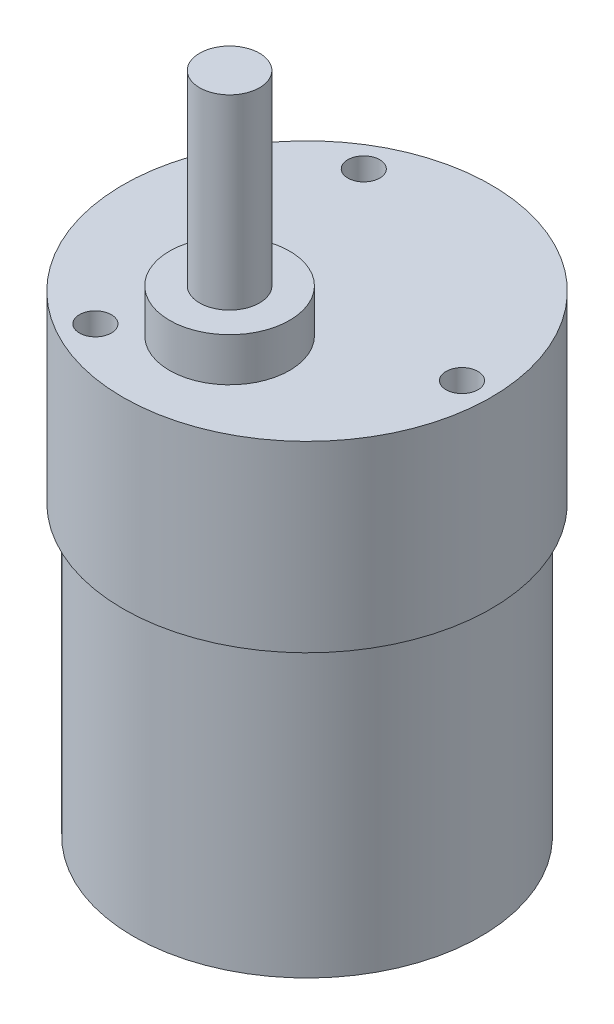
ISO-10303-21;
HEADER;
FILE_DESCRIPTION(('STEP AP214'),'2;1');
FILE_NAME('part.step','',(''),(''),'','','');
FILE_SCHEMA(('AUTOMOTIVE_DESIGN { 1 0 10303 214 1 1 1 1 }'));
ENDSEC;
DATA;
#1=APPLICATION_CONTEXT('core data for automotive mechanical design processes');
#2=APPLICATION_PROTOCOL_DEFINITION('international standard','automotive_design',2000,#1);
#3=PRODUCT_CONTEXT('',#1,'mechanical');
#4=PRODUCT('Part','Part','',(#3));
#5=PRODUCT_RELATED_PRODUCT_CATEGORY('part','',(#4));
#6=PRODUCT_DEFINITION_FORMATION('','',#4);
#7=PRODUCT_DEFINITION_CONTEXT('part definition',#1,'design');
#8=PRODUCT_DEFINITION('design','',#6,#7);
#9=PRODUCT_DEFINITION_SHAPE('','',#8);
#10=(LENGTH_UNIT() NAMED_UNIT(*) SI_UNIT(.MILLI.,.METRE.));
#11=(NAMED_UNIT(*) PLANE_ANGLE_UNIT() SI_UNIT($,.RADIAN.));
#12=(NAMED_UNIT(*) SI_UNIT($,.STERADIAN.) SOLID_ANGLE_UNIT());
#13=UNCERTAINTY_MEASURE_WITH_UNIT(LENGTH_MEASURE(1.E-05),#10,'distance_accuracy_value','');
#14=(GEOMETRIC_REPRESENTATION_CONTEXT(3) GLOBAL_UNCERTAINTY_ASSIGNED_CONTEXT((#13)) GLOBAL_UNIT_ASSIGNED_CONTEXT((#10,
#11,#12)) REPRESENTATION_CONTEXT('',''));
#15=CARTESIAN_POINT('',(0.,0.,0.));
#16=DIRECTION('',(0.,0.,1.));
#17=DIRECTION('',(1.,0.,0.));
#18=AXIS2_PLACEMENT_3D('',#15,#16,#17);
#19=CARTESIAN_POINT('',(0.,51.2826,7.70629818806232));
#20=DIRECTION('',(0.,1.,0.));
#21=DIRECTION('',(0.,0.,1.));
#22=AXIS2_PLACEMENT_3D('',#19,#20,#21);
#23=PLANE('',#22);
#24=CARTESIAN_POINT('',(0.,51.2826,7.70629818806232));
#25=DIRECTION('',(0.,1.,0.));
#26=DIRECTION('',(0.,0.,1.));
#27=AXIS2_PLACEMENT_3D('',#24,#25,#26);
#28=CIRCLE('',#27,5.969);
#29=CARTESIAN_POINT('',(0.,51.2826,13.6752981880623));
#30=VERTEX_POINT('',#29);
#31=EDGE_CURVE('E64',#30,#30,#28,.T.);
#32=ORIENTED_EDGE('',*,*,#31,.T.);
#33=EDGE_LOOP('',(#32));
#34=FACE_BOUND('',#33,.T.);
#35=CARTESIAN_POINT('',(0.,51.2826,7.70629818806232));
#36=DIRECTION('',(0.,1.,0.));
#37=DIRECTION('',(0.,0.,1.));
#38=AXIS2_PLACEMENT_3D('',#35,#36,#37);
#39=CIRCLE('',#38,2.97815);
#40=CARTESIAN_POINT('',(0.,51.2826,10.6844481880623));
#41=VERTEX_POINT('',#40);
#42=EDGE_CURVE('E73',#41,#41,#39,.T.);
#43=ORIENTED_EDGE('',*,*,#42,.F.);
#44=EDGE_LOOP('',(#43));
#45=FACE_BOUND('',#44,.T.);
#46=ADVANCED_FACE('F30',(#34,#45),#23,.T.);
#47=CARTESIAN_POINT('',(0.,46.9646,0.));
#48=DIRECTION('',(0.,1.,0.));
#49=DIRECTION('',(0.,0.,1.));
#50=AXIS2_PLACEMENT_3D('',#47,#48,#49);
#51=PLANE('',#50);
#52=CARTESIAN_POINT('',(0.,46.9646,0.));
#53=DIRECTION('',(0.,1.,0.));
#54=DIRECTION('',(0.,0.,1.));
#55=AXIS2_PLACEMENT_3D('',#52,#53,#54);
#56=CIRCLE('',#55,18.30705);
#57=CARTESIAN_POINT('',(0.,46.9646,18.30705));
#58=VERTEX_POINT('',#57);
#59=EDGE_CURVE('E41',#58,#58,#56,.T.);
#60=ORIENTED_EDGE('',*,*,#59,.T.);
#61=EDGE_LOOP('',(#60));
#62=FACE_BOUND('',#61,.T.);
#63=CARTESIAN_POINT('',(-7.70629818806238,46.9646,13.3477));
#64=DIRECTION('',(0.,1.,0.));
#65=DIRECTION('',(0.,0.,1.));
#66=AXIS2_PLACEMENT_3D('',#63,#64,#65);
#67=CIRCLE('',#66,1.5875);
#68=CARTESIAN_POINT('',(-7.70629818806238,46.9646,14.9352));
#69=VERTEX_POINT('',#68);
#70=EDGE_CURVE('E49',#69,#69,#67,.T.);
#71=ORIENTED_EDGE('',*,*,#70,.F.);
#72=EDGE_LOOP('',(#71));
#73=FACE_BOUND('',#72,.T.);
#74=CARTESIAN_POINT('',(-7.70629818806236,46.9646,-13.3477));
#75=DIRECTION('',(0.,1.,0.));
#76=DIRECTION('',(0.,0.,1.));
#77=AXIS2_PLACEMENT_3D('',#74,#75,#76);
#78=CIRCLE('',#77,1.5875);
#79=CARTESIAN_POINT('',(-7.70629818806236,46.9646,-11.7602));
#80=VERTEX_POINT('',#79);
#81=EDGE_CURVE('E55',#80,#80,#78,.T.);
#82=ORIENTED_EDGE('',*,*,#81,.F.);
#83=EDGE_LOOP('',(#82));
#84=FACE_BOUND('',#83,.T.);
#85=CARTESIAN_POINT('',(15.4125963761247,46.9646,0.));
#86=DIRECTION('',(0.,1.,0.));
#87=DIRECTION('',(0.,0.,1.));
#88=AXIS2_PLACEMENT_3D('',#85,#86,#87);
#89=CIRCLE('',#88,1.5875);
#90=CARTESIAN_POINT('',(15.4125963761247,46.9646,1.5875));
#91=VERTEX_POINT('',#90);
#92=EDGE_CURVE('E61',#91,#91,#89,.T.);
#93=ORIENTED_EDGE('',*,*,#92,.F.);
#94=EDGE_LOOP('',(#93));
#95=FACE_BOUND('',#94,.T.);
#96=CARTESIAN_POINT('',(0.,46.9646,7.70629818806232));
#97=DIRECTION('',(0.,1.,0.));
#98=DIRECTION('',(0.,0.,1.));
#99=AXIS2_PLACEMENT_3D('',#96,#97,#98);
#100=CIRCLE('',#99,5.969);
#101=CARTESIAN_POINT('',(0.,46.9646,13.6752981880623));
#102=VERTEX_POINT('',#101);
#103=EDGE_CURVE('E67',#102,#102,#100,.T.);
#104=ORIENTED_EDGE('',*,*,#103,.F.);
#105=EDGE_LOOP('',(#104));
#106=FACE_BOUND('',#105,.T.);
#107=ADVANCED_FACE('F89',(#62,#73,#84,#95,#106),#51,.T.);
#108=CARTESIAN_POINT('',(0.,28.7528,0.));
#109=DIRECTION('',(0.,-1.,0.));
#110=DIRECTION('',(0.,0.,-1.));
#111=AXIS2_PLACEMENT_3D('',#108,#109,#110);
#112=CYLINDRICAL_SURFACE('',#111,17.2593);
#113=CARTESIAN_POINT('',(0.,28.7528,0.));
#114=DIRECTION('',(0.,1.,0.));
#115=DIRECTION('',(0.,0.,1.));
#116=AXIS2_PLACEMENT_3D('',#113,#114,#115);
#117=CIRCLE('',#116,17.2593);
#118=CARTESIAN_POINT('',(0.,28.7528,17.2593));
#119=VERTEX_POINT('',#118);
#120=EDGE_CURVE('E10',#119,#119,#117,.T.);
#121=ORIENTED_EDGE('',*,*,#120,.F.);
#122=EDGE_LOOP('',(#121));
#123=FACE_BOUND('',#122,.T.);
#124=CARTESIAN_POINT('',(0.,0.,0.));
#125=DIRECTION('',(0.,1.,0.));
#126=DIRECTION('',(0.,0.,1.));
#127=AXIS2_PLACEMENT_3D('',#124,#125,#126);
#128=CIRCLE('',#127,17.2593);
#129=CARTESIAN_POINT('',(0.,0.,17.2593));
#130=VERTEX_POINT('',#129);
#131=EDGE_CURVE('E34',#130,#130,#128,.T.);
#132=ORIENTED_EDGE('',*,*,#131,.T.);
#133=EDGE_LOOP('',(#132));
#134=FACE_BOUND('',#133,.T.);
#135=ADVANCED_FACE('F32',(#123,#134),#112,.T.);
#136=CARTESIAN_POINT('',(0.,0.,0.));
#137=DIRECTION('',(0.,1.,0.));
#138=DIRECTION('',(0.,0.,1.));
#139=AXIS2_PLACEMENT_3D('',#136,#137,#138);
#140=PLANE('',#139);
#141=ORIENTED_EDGE('',*,*,#131,.F.);
#142=EDGE_LOOP('',(#141));
#143=FACE_BOUND('',#142,.T.);
#144=ADVANCED_FACE('F130',(#143),#140,.F.);
#145=CARTESIAN_POINT('',(0.,28.7528,0.));
#146=DIRECTION('',(0.,1.,0.));
#147=DIRECTION('',(0.,0.,1.));
#148=AXIS2_PLACEMENT_3D('',#145,#146,#147);
#149=PLANE('',#148);
#150=CARTESIAN_POINT('',(0.,28.7528,0.));
#151=DIRECTION('',(0.,1.,0.));
#152=DIRECTION('',(0.,0.,1.));
#153=AXIS2_PLACEMENT_3D('',#150,#151,#152);
#154=CIRCLE('',#153,18.30705);
#155=CARTESIAN_POINT('',(0.,28.7528,18.30705));
#156=VERTEX_POINT('',#155);
#157=EDGE_CURVE('E43',#156,#156,#154,.T.);
#158=ORIENTED_EDGE('',*,*,#157,.F.);
#159=EDGE_LOOP('',(#158));
#160=FACE_BOUND('',#159,.T.);
#161=ORIENTED_EDGE('',*,*,#120,.T.);
#162=EDGE_LOOP('',(#161));
#163=FACE_BOUND('',#162,.T.);
#164=ADVANCED_FACE('F127',(#160,#163),#149,.F.);
#165=CARTESIAN_POINT('',(0.,46.9646,0.));
#166=DIRECTION('',(0.,-1.,0.));
#167=DIRECTION('',(0.,0.,-1.));
#168=AXIS2_PLACEMENT_3D('',#165,#166,#167);
#169=CYLINDRICAL_SURFACE('',#168,18.30705);
#170=ORIENTED_EDGE('',*,*,#59,.F.);
#171=EDGE_LOOP('',(#170));
#172=FACE_BOUND('',#171,.T.);
#173=ORIENTED_EDGE('',*,*,#157,.T.);
#174=EDGE_LOOP('',(#173));
#175=FACE_BOUND('',#174,.T.);
#176=ADVANCED_FACE('F124',(#172,#175),#169,.T.);
#177=CARTESIAN_POINT('',(-7.70629818806238,34.2646,13.3477));
#178=DIRECTION('',(0.,1.,0.));
#179=DIRECTION('',(0.,0.,1.));
#180=AXIS2_PLACEMENT_3D('',#177,#178,#179);
#181=CYLINDRICAL_SURFACE('',#180,1.5875);
#182=CARTESIAN_POINT('',(-7.70629818806238,34.2646,13.3477));
#183=DIRECTION('',(0.,1.,0.));
#184=DIRECTION('',(0.,0.,1.));
#185=AXIS2_PLACEMENT_3D('',#182,#183,#184);
#186=CIRCLE('',#185,1.5875);
#187=CARTESIAN_POINT('',(-7.70629818806238,34.2646,14.9352));
#188=VERTEX_POINT('',#187);
#189=EDGE_CURVE('E46',#188,#188,#186,.T.);
#190=ORIENTED_EDGE('',*,*,#189,.F.);
#191=EDGE_LOOP('',(#190));
#192=FACE_BOUND('',#191,.T.);
#193=ORIENTED_EDGE('',*,*,#70,.T.);
#194=EDGE_LOOP('',(#193));
#195=FACE_BOUND('',#194,.T.);
#196=ADVANCED_FACE('F121',(#192,#195),#181,.F.);
#197=CARTESIAN_POINT('',(-7.70629818806238,34.2646,13.3477));
#198=DIRECTION('',(0.,1.,0.));
#199=DIRECTION('',(0.,0.,1.));
#200=AXIS2_PLACEMENT_3D('',#197,#198,#199);
#201=PLANE('',#200);
#202=ORIENTED_EDGE('',*,*,#189,.T.);
#203=EDGE_LOOP('',(#202));
#204=FACE_BOUND('',#203,.T.);
#205=ADVANCED_FACE('F117',(#204),#201,.T.);
#206=CARTESIAN_POINT('',(-7.70629818806236,34.2646,-13.3477));
#207=DIRECTION('',(0.,1.,0.));
#208=DIRECTION('',(0.,0.,1.));
#209=AXIS2_PLACEMENT_3D('',#206,#207,#208);
#210=CYLINDRICAL_SURFACE('',#209,1.5875);
#211=CARTESIAN_POINT('',(-7.70629818806236,34.2646,-13.3477));
#212=DIRECTION('',(0.,1.,0.));
#213=DIRECTION('',(0.,0.,1.));
#214=AXIS2_PLACEMENT_3D('',#211,#212,#213);
#215=CIRCLE('',#214,1.5875);
#216=CARTESIAN_POINT('',(-7.70629818806236,34.2646,-11.7602));
#217=VERTEX_POINT('',#216);
#218=EDGE_CURVE('E52',#217,#217,#215,.T.);
#219=ORIENTED_EDGE('',*,*,#218,.F.);
#220=EDGE_LOOP('',(#219));
#221=FACE_BOUND('',#220,.T.);
#222=ORIENTED_EDGE('',*,*,#81,.T.);
#223=EDGE_LOOP('',(#222));
#224=FACE_BOUND('',#223,.T.);
#225=ADVANCED_FACE('F113',(#221,#224),#210,.F.);
#226=CARTESIAN_POINT('',(-7.70629818806236,34.2646,-13.3477));
#227=DIRECTION('',(0.,1.,0.));
#228=DIRECTION('',(0.,0.,1.));
#229=AXIS2_PLACEMENT_3D('',#226,#227,#228);
#230=PLANE('',#229);
#231=ORIENTED_EDGE('',*,*,#218,.T.);
#232=EDGE_LOOP('',(#231));
#233=FACE_BOUND('',#232,.T.);
#234=ADVANCED_FACE('F109',(#233),#230,.T.);
#235=CARTESIAN_POINT('',(15.4125963761247,34.2646,0.));
#236=DIRECTION('',(0.,1.,0.));
#237=DIRECTION('',(0.,0.,1.));
#238=AXIS2_PLACEMENT_3D('',#235,#236,#237);
#239=CYLINDRICAL_SURFACE('',#238,1.5875);
#240=CARTESIAN_POINT('',(15.4125963761247,34.2646,0.));
#241=DIRECTION('',(0.,1.,0.));
#242=DIRECTION('',(0.,0.,1.));
#243=AXIS2_PLACEMENT_3D('',#240,#241,#242);
#244=CIRCLE('',#243,1.5875);
#245=CARTESIAN_POINT('',(15.4125963761247,34.2646,1.5875));
#246=VERTEX_POINT('',#245);
#247=EDGE_CURVE('E58',#246,#246,#244,.T.);
#248=ORIENTED_EDGE('',*,*,#247,.F.);
#249=EDGE_LOOP('',(#248));
#250=FACE_BOUND('',#249,.T.);
#251=ORIENTED_EDGE('',*,*,#92,.T.);
#252=EDGE_LOOP('',(#251));
#253=FACE_BOUND('',#252,.T.);
#254=ADVANCED_FACE('F105',(#250,#253),#239,.F.);
#255=CARTESIAN_POINT('',(15.4125963761247,34.2646,0.));
#256=DIRECTION('',(0.,1.,0.));
#257=DIRECTION('',(0.,0.,1.));
#258=AXIS2_PLACEMENT_3D('',#255,#256,#257);
#259=PLANE('',#258);
#260=ORIENTED_EDGE('',*,*,#247,.T.);
#261=EDGE_LOOP('',(#260));
#262=FACE_BOUND('',#261,.T.);
#263=ADVANCED_FACE('F101',(#262),#259,.T.);
#264=CARTESIAN_POINT('',(0.,51.2826,7.70629818806232));
#265=DIRECTION('',(0.,-1.,0.));
#266=DIRECTION('',(0.,0.,-1.));
#267=AXIS2_PLACEMENT_3D('',#264,#265,#266);
#268=CYLINDRICAL_SURFACE('',#267,5.969);
#269=ORIENTED_EDGE('',*,*,#31,.F.);
#270=EDGE_LOOP('',(#269));
#271=FACE_BOUND('',#270,.T.);
#272=ORIENTED_EDGE('',*,*,#103,.T.);
#273=EDGE_LOOP('',(#272));
#274=FACE_BOUND('',#273,.T.);
#275=ADVANCED_FACE('F84',(#271,#274),#268,.T.);
#276=CARTESIAN_POINT('',(0.,69.8246,7.70629818806232));
#277=DIRECTION('',(0.,-1.,0.));
#278=DIRECTION('',(0.,0.,-1.));
#279=AXIS2_PLACEMENT_3D('',#276,#277,#278);
#280=CYLINDRICAL_SURFACE('',#279,2.97815);
#281=CARTESIAN_POINT('',(0.,69.8246,7.70629818806232));
#282=DIRECTION('',(0.,1.,0.));
#283=DIRECTION('',(0.,0.,1.));
#284=AXIS2_PLACEMENT_3D('',#281,#282,#283);
#285=CIRCLE('',#284,2.97815);
#286=CARTESIAN_POINT('',(0.,69.8246,10.6844481880623));
#287=VERTEX_POINT('',#286);
#288=EDGE_CURVE('E70',#287,#287,#285,.T.);
#289=ORIENTED_EDGE('',*,*,#288,.F.);
#290=EDGE_LOOP('',(#289));
#291=FACE_BOUND('',#290,.T.);
#292=ORIENTED_EDGE('',*,*,#42,.T.);
#293=EDGE_LOOP('',(#292));
#294=FACE_BOUND('',#293,.T.);
#295=ADVANCED_FACE('F81',(#291,#294),#280,.T.);
#296=CARTESIAN_POINT('',(0.,69.8246,7.70629818806232));
#297=DIRECTION('',(0.,1.,0.));
#298=DIRECTION('',(0.,0.,1.));
#299=AXIS2_PLACEMENT_3D('',#296,#297,#298);
#300=PLANE('',#299);
#301=ORIENTED_EDGE('',*,*,#288,.T.);
#302=EDGE_LOOP('',(#301));
#303=FACE_BOUND('',#302,.T.);
#304=ADVANCED_FACE('F79',(#303),#300,.T.);
#305=CLOSED_SHELL('',(#46,#107,#135,#144,#164,#176,#196,#205,#225,#234,#254,#263,#275,#295,#304));
#306=MANIFOLD_SOLID_BREP('B2',#305);
#307=ADVANCED_BREP_SHAPE_REPRESENTATION('',(#18,#306),#14);
#308=SHAPE_DEFINITION_REPRESENTATION(#9,#307);
ENDSEC;
END-ISO-10303-21;
